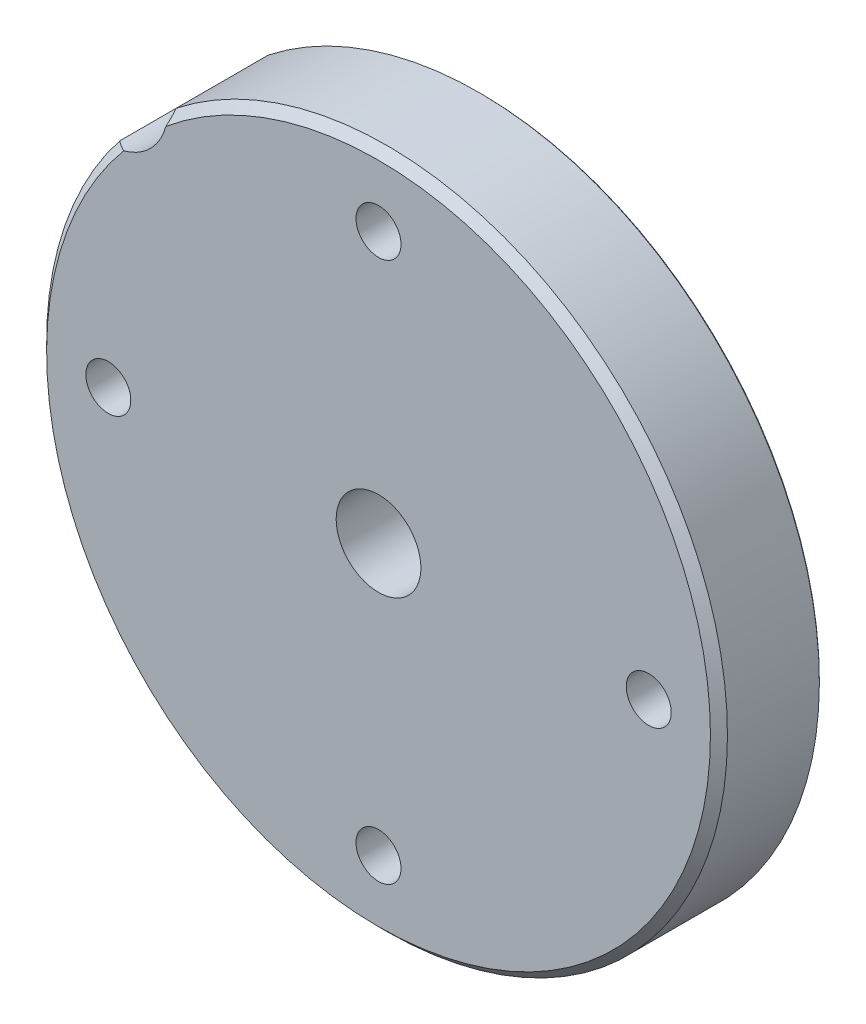
ISO-10303-21;
HEADER;
FILE_DESCRIPTION(('STEP AP214'),'2;1');
FILE_NAME('part.step','',(''),(''),'','','');
FILE_SCHEMA(('AUTOMOTIVE_DESIGN { 1 0 10303 214 1 1 1 1 }'));
ENDSEC;
DATA;
#1=APPLICATION_CONTEXT('core data for automotive mechanical design processes');
#2=APPLICATION_PROTOCOL_DEFINITION('international standard','automotive_design',2000,#1);
#3=PRODUCT_CONTEXT('',#1,'mechanical');
#4=PRODUCT('Part','Part','',(#3));
#5=PRODUCT_RELATED_PRODUCT_CATEGORY('part','',(#4));
#6=PRODUCT_DEFINITION_FORMATION('','',#4);
#7=PRODUCT_DEFINITION_CONTEXT('part definition',#1,'design');
#8=PRODUCT_DEFINITION('design','',#6,#7);
#9=PRODUCT_DEFINITION_SHAPE('','',#8);
#10=(LENGTH_UNIT() NAMED_UNIT(*) SI_UNIT(.MILLI.,.METRE.));
#11=(NAMED_UNIT(*) PLANE_ANGLE_UNIT() SI_UNIT($,.RADIAN.));
#12=(NAMED_UNIT(*) SI_UNIT($,.STERADIAN.) SOLID_ANGLE_UNIT());
#13=UNCERTAINTY_MEASURE_WITH_UNIT(LENGTH_MEASURE(1.E-05),#10,'distance_accuracy_value','');
#14=(GEOMETRIC_REPRESENTATION_CONTEXT(3) GLOBAL_UNCERTAINTY_ASSIGNED_CONTEXT((#13)) GLOBAL_UNIT_ASSIGNED_CONTEXT((#10,
#11,#12)) REPRESENTATION_CONTEXT('',''));
#15=CARTESIAN_POINT('',(0.,0.,0.));
#16=DIRECTION('',(0.,0.,1.));
#17=DIRECTION('',(1.,0.,0.));
#18=AXIS2_PLACEMENT_3D('',#15,#16,#17);
#19=CARTESIAN_POINT('',(0.,0.,-8.5));
#20=DIRECTION('',(0.,0.,1.));
#21=DIRECTION('',(1.,0.,0.));
#22=AXIS2_PLACEMENT_3D('',#19,#20,#21);
#23=CYLINDRICAL_SURFACE('',#22,5.6);
#24=CARTESIAN_POINT('',(0.,0.,-8.5));
#25=DIRECTION('',(0.,0.,1.));
#26=DIRECTION('',(1.,0.,0.));
#27=AXIS2_PLACEMENT_3D('',#24,#25,#26);
#28=CIRCLE('',#27,5.6);
#29=CARTESIAN_POINT('',(5.6,0.,-8.5));
#30=VERTEX_POINT('',#29);
#31=EDGE_CURVE('E353',#30,#30,#28,.F.);
#32=ORIENTED_EDGE('',*,*,#31,.T.);
#33=EDGE_LOOP('',(#32));
#34=FACE_BOUND('',#33,.T.);
#35=CARTESIAN_POINT('',(0.,0.,-7.));
#36=DIRECTION('',(0.,0.,1.));
#37=DIRECTION('',(1.,0.,0.));
#38=AXIS2_PLACEMENT_3D('',#35,#36,#37);
#39=CIRCLE('',#38,5.6);
#40=CARTESIAN_POINT('',(5.6,0.,-7.));
#41=VERTEX_POINT('',#40);
#42=EDGE_CURVE('E359',#41,#41,#39,.F.);
#43=ORIENTED_EDGE('',*,*,#42,.F.);
#44=EDGE_LOOP('',(#43));
#45=FACE_BOUND('',#44,.T.);
#46=ADVANCED_FACE('F17',(#34,#45),#23,.F.);
#47=CARTESIAN_POINT('',(0.,0.,-8.5));
#48=DIRECTION('',(0.,0.,-1.));
#49=DIRECTION('',(-1.,0.,0.));
#50=AXIS2_PLACEMENT_3D('',#47,#48,#49);
#51=PLANE('',#50);
#52=CARTESIAN_POINT('',(0.,0.,-8.5));
#53=DIRECTION('',(0.,0.,-1.));
#54=DIRECTION('',(-1.,0.,0.));
#55=AXIS2_PLACEMENT_3D('',#52,#53,#54);
#56=CIRCLE('',#55,5.5);
#57=CARTESIAN_POINT('',(-5.5,0.,-8.5));
#58=VERTEX_POINT('',#57);
#59=EDGE_CURVE('E362',#58,#58,#56,.F.);
#60=ORIENTED_EDGE('',*,*,#59,.F.);
#61=EDGE_LOOP('',(#60));
#62=FACE_BOUND('',#61,.T.);
#63=ORIENTED_EDGE('',*,*,#31,.F.);
#64=EDGE_LOOP('',(#63));
#65=FACE_BOUND('',#64,.T.);
#66=ADVANCED_FACE('F207',(#62,#65),#51,.F.);
#67=CARTESIAN_POINT('',(0.,0.,-7.));
#68=DIRECTION('',(0.,0.,1.));
#69=DIRECTION('',(1.,0.,0.));
#70=AXIS2_PLACEMENT_3D('',#67,#68,#69);
#71=PLANE('',#70);
#72=ORIENTED_EDGE('',*,*,#42,.T.);
#73=EDGE_LOOP('',(#72));
#74=FACE_BOUND('',#73,.T.);
#75=CARTESIAN_POINT('',(0.,0.,-7.));
#76=DIRECTION('',(0.,0.,1.));
#77=DIRECTION('',(1.,0.,0.));
#78=AXIS2_PLACEMENT_3D('',#75,#76,#77);
#79=CIRCLE('',#78,7.5);
#80=CARTESIAN_POINT('',(7.5,0.,-7.));
#81=VERTEX_POINT('',#80);
#82=EDGE_CURVE('E365',#81,#81,#79,.F.);
#83=ORIENTED_EDGE('',*,*,#82,.F.);
#84=EDGE_LOOP('',(#83));
#85=FACE_BOUND('',#84,.T.);
#86=ADVANCED_FACE('F203',(#74,#85),#71,.T.);
#87=CARTESIAN_POINT('',(0.,0.,-6.));
#88=DIRECTION('',(0.,0.,-1.));
#89=DIRECTION('',(-1.,0.,0.));
#90=AXIS2_PLACEMENT_3D('',#87,#88,#89);
#91=CYLINDRICAL_SURFACE('',#90,5.5);
#92=CARTESIAN_POINT('',(0.,0.,-6.));
#93=DIRECTION('',(0.,0.,-1.));
#94=DIRECTION('',(-1.,0.,0.));
#95=AXIS2_PLACEMENT_3D('',#92,#93,#94);
#96=CIRCLE('',#95,5.5);
#97=CARTESIAN_POINT('',(-5.5,0.,-6.));
#98=VERTEX_POINT('',#97);
#99=EDGE_CURVE('E90',#98,#98,#96,.F.);
#100=ORIENTED_EDGE('',*,*,#99,.F.);
#101=EDGE_LOOP('',(#100));
#102=FACE_BOUND('',#101,.T.);
#103=ORIENTED_EDGE('',*,*,#59,.T.);
#104=EDGE_LOOP('',(#103));
#105=FACE_BOUND('',#104,.T.);
#106=ADVANCED_FACE('F200',(#102,#105),#91,.T.);
#107=CARTESIAN_POINT('',(0.,6.,-10.));
#108=DIRECTION('',(0.,0.,-1.));
#109=DIRECTION('',(0.,1.,0.));
#110=AXIS2_PLACEMENT_3D('',#107,#108,#109);
#111=CONICAL_SURFACE('',#110,0.750000000000001,1.02974425867665);
#112=CARTESIAN_POINT('',(0.,6.,-9.54935453572933));
#113=VERTEX_POINT('',#112);
#114=VERTEX_LOOP('',#113);
#115=FACE_BOUND('',#114,.T.);
#116=CARTESIAN_POINT('',(0.,6.,-10.));
#117=DIRECTION('',(0.,0.,-1.));
#118=DIRECTION('',(-1.,0.,0.));
#119=AXIS2_PLACEMENT_3D('',#116,#117,#118);
#120=CIRCLE('',#119,0.75);
#121=CARTESIAN_POINT('',(-0.750000000000005,6.,-10.));
#122=VERTEX_POINT('',#121);
#123=EDGE_CURVE('E84',#122,#122,#120,.T.);
#124=ORIENTED_EDGE('',*,*,#123,.T.);
#125=EDGE_LOOP('',(#124));
#126=FACE_BOUND('',#125,.T.);
#127=ADVANCED_FACE('F77',(#115,#126),#111,.F.);
#128=CARTESIAN_POINT('',(0.,-6.,-10.));
#129=DIRECTION('',(0.,0.,-1.));
#130=DIRECTION('',(0.,1.,0.));
#131=AXIS2_PLACEMENT_3D('',#128,#129,#130);
#132=CONICAL_SURFACE('',#131,0.75,1.02974425867665);
#133=CARTESIAN_POINT('',(0.,-6.,-9.54935453572933));
#134=VERTEX_POINT('',#133);
#135=VERTEX_LOOP('',#134);
#136=FACE_BOUND('',#135,.T.);
#137=CARTESIAN_POINT('',(0.,-6.,-10.));
#138=DIRECTION('',(0.,0.,-1.));
#139=DIRECTION('',(-1.,0.,0.));
#140=AXIS2_PLACEMENT_3D('',#137,#138,#139);
#141=CIRCLE('',#140,0.750000000000002);
#142=CARTESIAN_POINT('',(-0.749999999999997,-6.,-10.));
#143=VERTEX_POINT('',#142);
#144=EDGE_CURVE('E81',#143,#143,#141,.T.);
#145=ORIENTED_EDGE('',*,*,#144,.T.);
#146=EDGE_LOOP('',(#145));
#147=FACE_BOUND('',#146,.T.);
#148=ADVANCED_FACE('F73',(#136,#147),#132,.F.);
#149=CARTESIAN_POINT('',(0.,0.,-6.));
#150=DIRECTION('',(0.,0.,-1.));
#151=DIRECTION('',(-1.,0.,0.));
#152=AXIS2_PLACEMENT_3D('',#149,#150,#151);
#153=PLANE('',#152);
#154=ORIENTED_EDGE('',*,*,#99,.T.);
#155=EDGE_LOOP('',(#154));
#156=FACE_BOUND('',#155,.T.);
#157=CARTESIAN_POINT('',(0.,0.,-6.));
#158=DIRECTION('',(0.,0.,-1.));
#159=DIRECTION('',(-1.,0.,0.));
#160=AXIS2_PLACEMENT_3D('',#157,#158,#159);
#161=CIRCLE('',#160,10.5);
#162=CARTESIAN_POINT('',(-10.5,0.,-6.));
#163=VERTEX_POINT('',#162);
#164=EDGE_CURVE('E83',#163,#163,#161,.T.);
#165=ORIENTED_EDGE('',*,*,#164,.T.);
#166=EDGE_LOOP('',(#165));
#167=FACE_BOUND('',#166,.T.);
#168=ADVANCED_FACE('F76',(#156,#167),#153,.T.);
#169=CARTESIAN_POINT('',(0.,0.,-8.5));
#170=DIRECTION('',(0.,0.,-1.));
#171=DIRECTION('',(0.,1.,0.));
#172=AXIS2_PLACEMENT_3D('',#169,#170,#171);
#173=CYLINDRICAL_SURFACE('',#172,7.5);
#174=CARTESIAN_POINT('',(0.,0.,-11.5));
#175=DIRECTION('',(0.,0.,-1.));
#176=DIRECTION('',(0.,1.,0.));
#177=AXIS2_PLACEMENT_3D('',#174,#175,#176);
#178=CIRCLE('',#177,7.5);
#179=CARTESIAN_POINT('',(0.,7.5,-11.5));
#180=VERTEX_POINT('',#179);
#181=EDGE_CURVE('E87',#180,#180,#178,.T.);
#182=ORIENTED_EDGE('',*,*,#181,.F.);
#183=EDGE_LOOP('',(#182));
#184=FACE_BOUND('',#183,.T.);
#185=ORIENTED_EDGE('',*,*,#82,.T.);
#186=EDGE_LOOP('',(#185));
#187=FACE_BOUND('',#186,.T.);
#188=ADVANCED_FACE('F192',(#184,#187),#173,.T.);
#189=CARTESIAN_POINT('',(0.,6.,-11.5));
#190=DIRECTION('',(0.,0.,1.));
#191=DIRECTION('',(1.,0.,0.));
#192=AXIS2_PLACEMENT_3D('',#189,#190,#191);
#193=CYLINDRICAL_SURFACE('',#192,0.75);
#194=ORIENTED_EDGE('',*,*,#123,.F.);
#195=EDGE_LOOP('',(#194));
#196=FACE_BOUND('',#195,.T.);
#197=CARTESIAN_POINT('',(0.,6.,-11.5));
#198=DIRECTION('',(0.,0.,1.));
#199=DIRECTION('',(1.,0.,0.));
#200=AXIS2_PLACEMENT_3D('',#197,#198,#199);
#201=CIRCLE('',#200,0.75);
#202=CARTESIAN_POINT('',(0.749999999999996,6.,-11.5));
#203=VERTEX_POINT('',#202);
#204=EDGE_CURVE('E372',#203,#203,#201,.T.);
#205=ORIENTED_EDGE('',*,*,#204,.F.);
#206=EDGE_LOOP('',(#205));
#207=FACE_BOUND('',#206,.T.);
#208=ADVANCED_FACE('F195',(#196,#207),#193,.F.);
#209=CARTESIAN_POINT('',(0.,-6.,-11.5));
#210=DIRECTION('',(0.,0.,1.));
#211=DIRECTION('',(1.,0.,0.));
#212=AXIS2_PLACEMENT_3D('',#209,#210,#211);
#213=CYLINDRICAL_SURFACE('',#212,0.750000000000002);
#214=ORIENTED_EDGE('',*,*,#144,.F.);
#215=EDGE_LOOP('',(#214));
#216=FACE_BOUND('',#215,.T.);
#217=CARTESIAN_POINT('',(0.,-6.,-11.5));
#218=DIRECTION('',(0.,0.,1.));
#219=DIRECTION('',(1.,0.,0.));
#220=AXIS2_PLACEMENT_3D('',#217,#218,#219);
#221=CIRCLE('',#220,0.750000000000002);
#222=CARTESIAN_POINT('',(0.750000000000007,-6.,-11.5));
#223=VERTEX_POINT('',#222);
#224=EDGE_CURVE('E375',#223,#223,#221,.T.);
#225=ORIENTED_EDGE('',*,*,#224,.F.);
#226=EDGE_LOOP('',(#225));
#227=FACE_BOUND('',#226,.T.);
#228=ADVANCED_FACE('F190',(#216,#227),#213,.F.);
#229=CARTESIAN_POINT('',(0.,0.,-6.));
#230=DIRECTION('',(0.,0.,-1.));
#231=DIRECTION('',(-1.,0.,0.));
#232=AXIS2_PLACEMENT_3D('',#229,#230,#231);
#233=CYLINDRICAL_SURFACE('',#232,10.5);
#234=ORIENTED_EDGE('',*,*,#164,.F.);
#235=EDGE_LOOP('',(#234));
#236=FACE_BOUND('',#235,.T.);
#237=CARTESIAN_POINT('',(0.,0.,-10.5));
#238=DIRECTION('',(0.,0.,-1.));
#239=DIRECTION('',(-1.,0.,0.));
#240=AXIS2_PLACEMENT_3D('',#237,#238,#239);
#241=CIRCLE('',#240,10.5);
#242=CARTESIAN_POINT('',(-10.5,0.,-10.5));
#243=VERTEX_POINT('',#242);
#244=EDGE_CURVE('E377',#243,#243,#241,.T.);
#245=ORIENTED_EDGE('',*,*,#244,.T.);
#246=EDGE_LOOP('',(#245));
#247=FACE_BOUND('',#246,.T.);
#248=ADVANCED_FACE('F186',(#236,#247),#233,.F.);
#249=CARTESIAN_POINT('',(0.,0.,-10.5));
#250=DIRECTION('',(0.,0.,1.));
#251=DIRECTION('',(1.,0.,0.));
#252=AXIS2_PLACEMENT_3D('',#249,#250,#251);
#253=PLANE('',#252);
#254=ORIENTED_EDGE('',*,*,#244,.F.);
#255=EDGE_LOOP('',(#254));
#256=FACE_BOUND('',#255,.T.);
#257=CARTESIAN_POINT('',(0.,0.,-10.5));
#258=DIRECTION('',(0.,0.,-1.));
#259=DIRECTION('',(-1.,0.,0.));
#260=AXIS2_PLACEMENT_3D('',#257,#258,#259);
#261=CIRCLE('',#260,13.);
#262=CARTESIAN_POINT('',(-13.,0.,-10.5));
#263=VERTEX_POINT('',#262);
#264=EDGE_CURVE('E162',#263,#263,#261,.F.);
#265=ORIENTED_EDGE('',*,*,#264,.F.);
#266=EDGE_LOOP('',(#265));
#267=FACE_BOUND('',#266,.T.);
#268=ADVANCED_FACE('F181',(#256,#267),#253,.F.);
#269=CARTESIAN_POINT('',(0.,0.,-5.89999999995513));
#270=DIRECTION('',(0.,0.,1.));
#271=DIRECTION('',(0.,-1.,0.));
#272=AXIS2_PLACEMENT_3D('',#269,#270,#271);
#273=CONICAL_SURFACE('',#272,19.9999999999551,0.785398162500006);
#274=CARTESIAN_POINT('',(-15.7086426515068,12.378955773649,-5.89999999994284));
#275=CARTESIAN_POINT('',(-15.6863217931569,12.3800149369185,-5.91687699793065));
#276=CARTESIAN_POINT('',(-15.6639376875693,12.3812957540872,-5.93364883022015));
#277=CARTESIAN_POINT('',(-15.6190429816601,12.3843006962397,-5.96698216359461));
#278=CARTESIAN_POINT('',(-15.596532381337,12.3860248212288,-5.98354366467714));
#279=CARTESIAN_POINT('',(-15.5739585337748,12.3879706001221,-6.00000000005895));
#280=B_SPLINE_CURVE_WITH_KNOTS('',3,(#274,#275,#276,#277,#278,#279),.UNSPECIFIED.,.F.,.F.,(4,2,
4),(0.,0.0839990910981078,0.167998183164096),.UNSPECIFIED.);
#281=CARTESIAN_POINT('',(-15.7086426515284,12.378955773648,-5.89999999997142));
#282=VERTEX_POINT('',#281);
#283=CARTESIAN_POINT('',(-15.5739585337846,12.3879706001212,-6.00000000003206));
#284=VERTEX_POINT('',#283);
#285=EDGE_CURVE('E165',#282,#284,#280,.T.);
#286=ORIENTED_EDGE('',*,*,#285,.T.);
#287=CARTESIAN_POINT('',(0.,0.,-6.00000000004487));
#288=DIRECTION('',(0.,0.,1.));
#289=DIRECTION('',(0.,-1.,0.));
#290=AXIS2_PLACEMENT_3D('',#287,#288,#289);
#291=CIRCLE('',#290,19.9000000000449);
#292=CARTESIAN_POINT('',(-12.3879706001212,15.5739585337846,-6.00000000003206));
#293=VERTEX_POINT('',#292);
#294=EDGE_CURVE('E159',#293,#284,#291,.F.);
#295=ORIENTED_EDGE('',*,*,#294,.F.);
#296=CARTESIAN_POINT('',(-12.3879706001066,15.5739585337682,-6.00000000005114));
#297=CARTESIAN_POINT('',(-12.3860248212211,15.5965323813338,-5.98354366467319));
#298=CARTESIAN_POINT('',(-12.3843006962372,15.6190429816591,-5.96698216359325));
#299=CARTESIAN_POINT('',(-12.3812957540897,15.6639376875705,-5.93364883022139));
#300=CARTESIAN_POINT('',(-12.3800149369211,15.6863217931581,-5.91687699793191));
#301=CARTESIAN_POINT('',(-12.378955773649,15.7086426515068,-5.89999999994284));
#302=B_SPLINE_CURVE_WITH_KNOTS('',3,(#296,#297,#298,#299,#300,#301),.UNSPECIFIED.,.F.,.F.,(4,2,
4),(0.,0.0839990920658283,0.167998183163858),.UNSPECIFIED.);
#303=CARTESIAN_POINT('',(-12.378955773648,15.7086426515284,-5.89999999997142));
#304=VERTEX_POINT('',#303);
#305=EDGE_CURVE('E57',#293,#304,#302,.T.);
#306=ORIENTED_EDGE('',*,*,#305,.T.);
#307=CARTESIAN_POINT('',(0.,0.,-5.9));
#308=DIRECTION('',(0.,0.,-1.));
#309=DIRECTION('',(-1.,0.,0.));
#310=AXIS2_PLACEMENT_3D('',#307,#308,#309);
#311=CIRCLE('',#310,20.);
#312=EDGE_CURVE('E94',#282,#304,#311,.F.);
#313=ORIENTED_EDGE('',*,*,#312,.F.);
#314=EDGE_LOOP('',(#286,#295,#306,#313));
#315=FACE_BOUND('',#314,.T.);
#316=ADVANCED_FACE('F175',(#315),#273,.T.);
#317=CARTESIAN_POINT('',(0.,0.,-6.));
#318=DIRECTION('',(0.,0.,-1.));
#319=DIRECTION('',(-1.,0.,0.));
#320=AXIS2_PLACEMENT_3D('',#317,#318,#319);
#321=CYLINDRICAL_SURFACE('',#320,13.);
#322=CARTESIAN_POINT('',(0.,0.,-6.));
#323=DIRECTION('',(0.,0.,-1.));
#324=DIRECTION('',(-1.,0.,0.));
#325=AXIS2_PLACEMENT_3D('',#322,#323,#324);
#326=CIRCLE('',#325,13.);
#327=CARTESIAN_POINT('',(-13.,0.,-6.));
#328=VERTEX_POINT('',#327);
#329=EDGE_CURVE('E156',#328,#328,#326,.F.);
#330=ORIENTED_EDGE('',*,*,#329,.F.);
#331=EDGE_LOOP('',(#330));
#332=FACE_BOUND('',#331,.T.);
#333=ORIENTED_EDGE('',*,*,#264,.T.);
#334=EDGE_LOOP('',(#333));
#335=FACE_BOUND('',#334,.T.);
#336=ADVANCED_FACE('F180',(#332,#335),#321,.T.);
#337=CARTESIAN_POINT('',(0.,0.,0.));
#338=DIRECTION('',(0.,0.,-1.));
#339=DIRECTION('',(-1.,0.,0.));
#340=AXIS2_PLACEMENT_3D('',#337,#338,#339);
#341=CYLINDRICAL_SURFACE('',#340,20.);
#342=DIRECTION('',(0.,0.,-1.));
#343=VECTOR('',#342,1.);
#344=CARTESIAN_POINT('',(-15.7086426515499,12.3789557736469,0.));
#345=LINE('',#344,#343);
#346=CARTESIAN_POINT('',(-15.7086426514015,12.378955773654,-0.500000000336547));
#347=VERTEX_POINT('',#346);
#348=EDGE_CURVE('E155',#347,#282,#345,.T.);
#349=ORIENTED_EDGE('',*,*,#348,.T.);
#350=ORIENTED_EDGE('',*,*,#312,.T.);
#351=DIRECTION('',(0.,0.,-1.));
#352=VECTOR('',#351,1.);
#353=CARTESIAN_POINT('',(-12.3789557736469,15.7086426515499,0.));
#354=LINE('',#353,#352);
#355=CARTESIAN_POINT('',(-12.378955773654,15.7086426514015,-0.500000000224363));
#356=VERTEX_POINT('',#355);
#357=EDGE_CURVE('E138',#304,#356,#354,.F.);
#358=ORIENTED_EDGE('',*,*,#357,.T.);
#359=CARTESIAN_POINT('',(0.,0.,-0.500000000224363));
#360=DIRECTION('',(0.,0.,-1.));
#361=DIRECTION('',(-1.,0.,0.));
#362=AXIS2_PLACEMENT_3D('',#359,#360,#361);
#363=CIRCLE('',#362,19.9999999997756);
#364=EDGE_CURVE('E65',#347,#356,#363,.F.);
#365=ORIENTED_EDGE('',*,*,#364,.F.);
#366=EDGE_LOOP('',(#349,#350,#358,#365));
#367=FACE_BOUND('',#366,.T.);
#368=ADVANCED_FACE('F385',(#367),#341,.T.);
#369=CARTESIAN_POINT('',(0.,0.,-11.5));
#370=DIRECTION('',(0.,0.,1.));
#371=DIRECTION('',(1.,0.,0.));
#372=AXIS2_PLACEMENT_3D('',#369,#370,#371);
#373=PLANE('',#372);
#374=CARTESIAN_POINT('',(0.,0.,-11.5));
#375=DIRECTION('',(0.,0.,-1.));
#376=DIRECTION('',(-1.,0.,0.));
#377=AXIS2_PLACEMENT_3D('',#374,#375,#376);
#378=CIRCLE('',#377,2.489);
#379=CARTESIAN_POINT('',(-2.489,0.,-11.5));
#380=VERTEX_POINT('',#379);
#381=EDGE_CURVE('E128',#380,#380,#378,.F.);
#382=ORIENTED_EDGE('',*,*,#381,.T.);
#383=EDGE_LOOP('',(#382));
#384=FACE_BOUND('',#383,.T.);
#385=ORIENTED_EDGE('',*,*,#224,.T.);
#386=EDGE_LOOP('',(#385));
#387=FACE_BOUND('',#386,.T.);
#388=ORIENTED_EDGE('',*,*,#204,.T.);
#389=EDGE_LOOP('',(#388));
#390=FACE_BOUND('',#389,.T.);
#391=ORIENTED_EDGE('',*,*,#181,.T.);
#392=EDGE_LOOP('',(#391));
#393=FACE_BOUND('',#392,.T.);
#394=ADVANCED_FACE('F390',(#384,#387,#390,#393),#373,.F.);
#395=CARTESIAN_POINT('',(0.,0.,-6.));
#396=DIRECTION('',(0.,0.,-1.));
#397=DIRECTION('',(-1.,0.,0.));
#398=AXIS2_PLACEMENT_3D('',#395,#396,#397);
#399=PLANE('',#398);
#400=ORIENTED_EDGE('',*,*,#329,.T.);
#401=EDGE_LOOP('',(#400));
#402=FACE_BOUND('',#401,.T.);
#403=CARTESIAN_POINT('',(0.,15.875,-6.));
#404=DIRECTION('',(0.,0.,-1.));
#405=DIRECTION('',(-1.,0.,0.));
#406=AXIS2_PLACEMENT_3D('',#403,#404,#405);
#407=CIRCLE('',#406,1.321);
#408=CARTESIAN_POINT('',(-1.321,15.875,-6.));
#409=VERTEX_POINT('',#408);
#410=EDGE_CURVE('E116',#409,#409,#407,.F.);
#411=ORIENTED_EDGE('',*,*,#410,.T.);
#412=EDGE_LOOP('',(#411));
#413=FACE_BOUND('',#412,.T.);
#414=CARTESIAN_POINT('',(-15.875,0.,-6.));
#415=DIRECTION('',(0.,0.,-1.));
#416=DIRECTION('',(-1.,0.,0.));
#417=AXIS2_PLACEMENT_3D('',#414,#415,#416);
#418=CIRCLE('',#417,1.321);
#419=CARTESIAN_POINT('',(-17.196,0.,-6.));
#420=VERTEX_POINT('',#419);
#421=EDGE_CURVE('E119',#420,#420,#418,.F.);
#422=ORIENTED_EDGE('',*,*,#421,.T.);
#423=EDGE_LOOP('',(#422));
#424=FACE_BOUND('',#423,.T.);
#425=CARTESIAN_POINT('',(0.,-15.875,-6.));
#426=DIRECTION('',(0.,0.,-1.));
#427=DIRECTION('',(-1.,0.,0.));
#428=AXIS2_PLACEMENT_3D('',#425,#426,#427);
#429=CIRCLE('',#428,1.321);
#430=CARTESIAN_POINT('',(-1.321,-15.875,-6.));
#431=VERTEX_POINT('',#430);
#432=EDGE_CURVE('E122',#431,#431,#429,.F.);
#433=ORIENTED_EDGE('',*,*,#432,.T.);
#434=EDGE_LOOP('',(#433));
#435=FACE_BOUND('',#434,.T.);
#436=CARTESIAN_POINT('',(15.875,0.,-6.));
#437=DIRECTION('',(0.,0.,-1.));
#438=DIRECTION('',(-1.,0.,0.));
#439=AXIS2_PLACEMENT_3D('',#436,#437,#438);
#440=CIRCLE('',#439,1.321);
#441=CARTESIAN_POINT('',(14.554,0.,-6.));
#442=VERTEX_POINT('',#441);
#443=EDGE_CURVE('E125',#442,#442,#440,.F.);
#444=ORIENTED_EDGE('',*,*,#443,.T.);
#445=EDGE_LOOP('',(#444));
#446=FACE_BOUND('',#445,.T.);
#447=CARTESIAN_POINT('',(-15.875,15.875,-6.));
#448=DIRECTION('',(0.,0.,-1.));
#449=DIRECTION('',(-1.,0.,0.));
#450=AXIS2_PLACEMENT_3D('',#447,#448,#449);
#451=CIRCLE('',#450,3.5);
#452=EDGE_CURVE('E139',#284,#293,#451,.F.);
#453=ORIENTED_EDGE('',*,*,#452,.T.);
#454=ORIENTED_EDGE('',*,*,#294,.T.);
#455=EDGE_LOOP('',(#453,#454));
#456=FACE_BOUND('',#455,.T.);
#457=ADVANCED_FACE('F148',(#402,#413,#424,#435,#446,#456),#399,.T.);
#458=CARTESIAN_POINT('',(0.,0.,-0.500000000224362));
#459=DIRECTION('',(0.,0.,-1.));
#460=DIRECTION('',(-1.,0.,0.));
#461=AXIS2_PLACEMENT_3D('',#458,#459,#460);
#462=CONICAL_SURFACE('',#461,19.9999999997756,0.7853981625);
#463=CARTESIAN_POINT('',(-14.9720796613635,12.4934715197705,3.03074630363293E-10));
#464=CARTESIAN_POINT('',(-15.0349118656529,12.4766971667001,-0.0374967032172429));
#465=CARTESIAN_POINT('',(-15.0974871059822,12.461861598597,-0.0762526913637164));
#466=CARTESIAN_POINT('',(-15.2218118801087,12.4359055815083,-0.155860450577804));
#467=CARTESIAN_POINT('',(-15.2835632844114,12.4247744660695,-0.196705806825764));
#468=CARTESIAN_POINT('',(-15.4062889045965,12.4059707605476,-0.280286681059573));
#469=CARTESIAN_POINT('',(-15.4672631989245,12.3982978186476,-0.323022006283722));
#470=CARTESIAN_POINT('',(-15.5885320631262,12.3862101108959,-0.410266968625191));
#471=CARTESIAN_POINT('',(-15.6488241358321,12.3818049003551,-0.454781411279927));
#472=CARTESIAN_POINT('',(-15.7086426513304,12.3789557736574,-0.500000000282737));
#473=B_SPLINE_CURVE_WITH_KNOTS('',3,(#463,#464,#465,#466,#467,#468,#469,#470,#471,#472),
.UNSPECIFIED.,.F.,.F.,(4,2,2,2,4),(0.,0.225141521834317,0.449629055320701,0.674093745442383,
0.899212242405961),.UNSPECIFIED.);
#474=CARTESIAN_POINT('',(-14.9720796614959,12.493471519813,1.8352917041078E-10));
#475=VERTEX_POINT('',#474);
#476=EDGE_CURVE('E36',#475,#347,#473,.T.);
#477=ORIENTED_EDGE('',*,*,#476,.T.);
#478=ORIENTED_EDGE('',*,*,#364,.T.);
#479=CARTESIAN_POINT('',(-12.378955773699,15.7086426513519,-0.500000000265221));
#480=CARTESIAN_POINT('',(-12.3818049003681,15.6488241358403,-0.454781411275603));
#481=CARTESIAN_POINT('',(-12.3862101108989,15.5885320631293,-0.410266968625058));
#482=CARTESIAN_POINT('',(-12.3982978186445,15.4672631989238,-0.323022006285581));
#483=CARTESIAN_POINT('',(-12.4059707605483,15.4062889045971,-0.28028668105924));
#484=CARTESIAN_POINT('',(-12.424774466069,15.2835632844099,-0.196705806825471));
#485=CARTESIAN_POINT('',(-12.4359055815026,15.2218118801037,-0.155860450579748));
#486=CARTESIAN_POINT('',(-12.4618615986037,15.0974871059821,-0.0762526913585421));
#487=CARTESIAN_POINT('',(-12.4766971667245,15.0349118656614,-0.0374967032026958));
#488=CARTESIAN_POINT('',(-12.4934715198399,14.9720796613952,3.40642924731453E-10));
#489=B_SPLINE_CURVE_WITH_KNOTS('',3,(#479,#480,#481,#482,#483,#484,#485,#486,#487,#488),
.UNSPECIFIED.,.F.,.F.,(4,2,2,2,4),(0.,0.225118496966822,0.449583187090194,0.67407072057887,
0.899212242417132),.UNSPECIFIED.);
#490=CARTESIAN_POINT('',(-12.493471519813,14.9720796614959,1.83527897573657E-10));
#491=VERTEX_POINT('',#490);
#492=EDGE_CURVE('E131',#356,#491,#489,.T.);
#493=ORIENTED_EDGE('',*,*,#492,.T.);
#494=CARTESIAN_POINT('',(0.,0.,2.24362520749588E-10));
#495=DIRECTION('',(0.,0.,-1.));
#496=DIRECTION('',(-1.,0.,0.));
#497=AXIS2_PLACEMENT_3D('',#494,#495,#496);
#498=CIRCLE('',#497,19.5000000002244);
#499=EDGE_CURVE('E113',#491,#475,#498,.T.);
#500=ORIENTED_EDGE('',*,*,#499,.T.);
#501=EDGE_LOOP('',(#477,#478,#493,#500));
#502=FACE_BOUND('',#501,.T.);
#503=ADVANCED_FACE('F144',(#502),#462,.T.);
#504=CARTESIAN_POINT('',(-15.875,15.875,0.));
#505=DIRECTION('',(0.,0.,-1.));
#506=DIRECTION('',(-1.,0.,0.));
#507=AXIS2_PLACEMENT_3D('',#504,#505,#506);
#508=CYLINDRICAL_SURFACE('',#507,3.5);
#509=ORIENTED_EDGE('',*,*,#357,.F.);
#510=ORIENTED_EDGE('',*,*,#305,.F.);
#511=ORIENTED_EDGE('',*,*,#452,.F.);
#512=ORIENTED_EDGE('',*,*,#285,.F.);
#513=ORIENTED_EDGE('',*,*,#348,.F.);
#514=ORIENTED_EDGE('',*,*,#476,.F.);
#515=CARTESIAN_POINT('',(-15.875,15.875,0.));
#516=DIRECTION('',(0.,0.,-1.));
#517=DIRECTION('',(-1.,0.,0.));
#518=AXIS2_PLACEMENT_3D('',#515,#516,#517);
#519=CIRCLE('',#518,3.5);
#520=EDGE_CURVE('E111',#475,#491,#519,.F.);
#521=ORIENTED_EDGE('',*,*,#520,.T.);
#522=ORIENTED_EDGE('',*,*,#492,.F.);
#523=EDGE_LOOP('',(#509,#510,#511,#512,#513,#514,#521,#522));
#524=FACE_BOUND('',#523,.T.);
#525=ADVANCED_FACE('F141',(#524),#508,.F.);
#526=CARTESIAN_POINT('',(0.,0.,0.));
#527=DIRECTION('',(0.,0.,-1.));
#528=DIRECTION('',(-1.,0.,0.));
#529=AXIS2_PLACEMENT_3D('',#526,#527,#528);
#530=CYLINDRICAL_SURFACE('',#529,2.489);
#531=ORIENTED_EDGE('',*,*,#381,.F.);
#532=EDGE_LOOP('',(#531));
#533=FACE_BOUND('',#532,.T.);
#534=CARTESIAN_POINT('',(0.,0.,0.));
#535=DIRECTION('',(0.,0.,-1.));
#536=DIRECTION('',(-1.,0.,0.));
#537=AXIS2_PLACEMENT_3D('',#534,#535,#536);
#538=CIRCLE('',#537,2.489);
#539=CARTESIAN_POINT('',(-2.489,0.,0.));
#540=VERTEX_POINT('',#539);
#541=EDGE_CURVE('E108',#540,#540,#538,.F.);
#542=ORIENTED_EDGE('',*,*,#541,.T.);
#543=EDGE_LOOP('',(#542));
#544=FACE_BOUND('',#543,.T.);
#545=ADVANCED_FACE('F223',(#533,#544),#530,.F.);
#546=CARTESIAN_POINT('',(15.875,0.,0.));
#547=DIRECTION('',(0.,0.,-1.));
#548=DIRECTION('',(-1.,0.,0.));
#549=AXIS2_PLACEMENT_3D('',#546,#547,#548);
#550=CYLINDRICAL_SURFACE('',#549,1.321);
#551=ORIENTED_EDGE('',*,*,#443,.F.);
#552=EDGE_LOOP('',(#551));
#553=FACE_BOUND('',#552,.T.);
#554=CARTESIAN_POINT('',(15.875,0.,0.));
#555=DIRECTION('',(0.,0.,-1.));
#556=DIRECTION('',(-1.,0.,0.));
#557=AXIS2_PLACEMENT_3D('',#554,#555,#556);
#558=CIRCLE('',#557,1.321);
#559=CARTESIAN_POINT('',(14.554,0.,0.));
#560=VERTEX_POINT('',#559);
#561=EDGE_CURVE('E105',#560,#560,#558,.F.);
#562=ORIENTED_EDGE('',*,*,#561,.T.);
#563=EDGE_LOOP('',(#562));
#564=FACE_BOUND('',#563,.T.);
#565=ADVANCED_FACE('F226',(#553,#564),#550,.F.);
#566=CARTESIAN_POINT('',(0.,-15.875,0.));
#567=DIRECTION('',(0.,0.,-1.));
#568=DIRECTION('',(-1.,0.,0.));
#569=AXIS2_PLACEMENT_3D('',#566,#567,#568);
#570=CYLINDRICAL_SURFACE('',#569,1.321);
#571=ORIENTED_EDGE('',*,*,#432,.F.);
#572=EDGE_LOOP('',(#571));
#573=FACE_BOUND('',#572,.T.);
#574=CARTESIAN_POINT('',(0.,-15.875,0.));
#575=DIRECTION('',(0.,0.,-1.));
#576=DIRECTION('',(-1.,0.,0.));
#577=AXIS2_PLACEMENT_3D('',#574,#575,#576);
#578=CIRCLE('',#577,1.321);
#579=CARTESIAN_POINT('',(-1.321,-15.875,0.));
#580=VERTEX_POINT('',#579);
#581=EDGE_CURVE('E102',#580,#580,#578,.F.);
#582=ORIENTED_EDGE('',*,*,#581,.T.);
#583=EDGE_LOOP('',(#582));
#584=FACE_BOUND('',#583,.T.);
#585=ADVANCED_FACE('F230',(#573,#584),#570,.F.);
#586=CARTESIAN_POINT('',(-15.875,0.,0.));
#587=DIRECTION('',(0.,0.,-1.));
#588=DIRECTION('',(-1.,0.,0.));
#589=AXIS2_PLACEMENT_3D('',#586,#587,#588);
#590=CYLINDRICAL_SURFACE('',#589,1.321);
#591=ORIENTED_EDGE('',*,*,#421,.F.);
#592=EDGE_LOOP('',(#591));
#593=FACE_BOUND('',#592,.T.);
#594=CARTESIAN_POINT('',(-15.875,0.,0.));
#595=DIRECTION('',(0.,0.,-1.));
#596=DIRECTION('',(-1.,0.,0.));
#597=AXIS2_PLACEMENT_3D('',#594,#595,#596);
#598=CIRCLE('',#597,1.321);
#599=CARTESIAN_POINT('',(-17.196,0.,0.));
#600=VERTEX_POINT('',#599);
#601=EDGE_CURVE('E27',#600,#600,#598,.F.);
#602=ORIENTED_EDGE('',*,*,#601,.T.);
#603=EDGE_LOOP('',(#602));
#604=FACE_BOUND('',#603,.T.);
#605=ADVANCED_FACE('F234',(#593,#604),#590,.F.);
#606=CARTESIAN_POINT('',(0.,15.875,0.));
#607=DIRECTION('',(0.,0.,-1.));
#608=DIRECTION('',(-1.,0.,0.));
#609=AXIS2_PLACEMENT_3D('',#606,#607,#608);
#610=CYLINDRICAL_SURFACE('',#609,1.321);
#611=ORIENTED_EDGE('',*,*,#410,.F.);
#612=EDGE_LOOP('',(#611));
#613=FACE_BOUND('',#612,.T.);
#614=CARTESIAN_POINT('',(0.,15.875,0.));
#615=DIRECTION('',(0.,0.,-1.));
#616=DIRECTION('',(-1.,0.,0.));
#617=AXIS2_PLACEMENT_3D('',#614,#615,#616);
#618=CIRCLE('',#617,1.321);
#619=CARTESIAN_POINT('',(-1.321,15.875,0.));
#620=VERTEX_POINT('',#619);
#621=EDGE_CURVE('E11',#620,#620,#618,.F.);
#622=ORIENTED_EDGE('',*,*,#621,.T.);
#623=EDGE_LOOP('',(#622));
#624=FACE_BOUND('',#623,.T.);
#625=ADVANCED_FACE('F237',(#613,#624),#610,.F.);
#626=CARTESIAN_POINT('',(0.,0.,0.));
#627=DIRECTION('',(0.,0.,-1.));
#628=DIRECTION('',(-1.,0.,0.));
#629=AXIS2_PLACEMENT_3D('',#626,#627,#628);
#630=PLANE('',#629);
#631=ORIENTED_EDGE('',*,*,#621,.F.);
#632=EDGE_LOOP('',(#631));
#633=FACE_BOUND('',#632,.T.);
#634=ORIENTED_EDGE('',*,*,#601,.F.);
#635=EDGE_LOOP('',(#634));
#636=FACE_BOUND('',#635,.T.);
#637=ORIENTED_EDGE('',*,*,#581,.F.);
#638=EDGE_LOOP('',(#637));
#639=FACE_BOUND('',#638,.T.);
#640=ORIENTED_EDGE('',*,*,#561,.F.);
#641=EDGE_LOOP('',(#640));
#642=FACE_BOUND('',#641,.T.);
#643=ORIENTED_EDGE('',*,*,#541,.F.);
#644=EDGE_LOOP('',(#643));
#645=FACE_BOUND('',#644,.T.);
#646=ORIENTED_EDGE('',*,*,#499,.F.);
#647=ORIENTED_EDGE('',*,*,#520,.F.);
#648=EDGE_LOOP('',(#646,#647));
#649=FACE_BOUND('',#648,.T.);
#650=ADVANCED_FACE('F240',(#633,#636,#639,#642,#645,#649),#630,.F.);
#651=CLOSED_SHELL('',(#46,#66,#86,#106,#127,#148,#168,#188,#208,#228,#248,#268,#316,#336,#368,
#394,#457,#503,#525,#545,#565,#585,#605,#625,#650));
#652=CARTESIAN_POINT('',(0.,0.,-8.5));
#653=DIRECTION('',(0.,0.,-1.));
#654=DIRECTION('',(-1.,0.,0.));
#655=AXIS2_PLACEMENT_3D('',#652,#653,#654);
#656=CYLINDRICAL_SURFACE('',#655,3.5);
#657=CARTESIAN_POINT('',(0.,0.,-8.5));
#658=DIRECTION('',(0.,0.,-1.));
#659=DIRECTION('',(-1.,0.,0.));
#660=AXIS2_PLACEMENT_3D('',#657,#658,#659);
#661=CIRCLE('',#660,3.5);
#662=CARTESIAN_POINT('',(-3.5,0.,-8.5));
#663=VERTEX_POINT('',#662);
#664=EDGE_CURVE('E21',#663,#663,#661,.T.);
#665=ORIENTED_EDGE('',*,*,#664,.T.);
#666=EDGE_LOOP('',(#665));
#667=FACE_BOUND('',#666,.T.);
#668=CARTESIAN_POINT('',(0.,0.,-9.5));
#669=DIRECTION('',(0.,0.,-1.));
#670=DIRECTION('',(-1.,0.,0.));
#671=AXIS2_PLACEMENT_3D('',#668,#669,#670);
#672=CIRCLE('',#671,3.5);
#673=CARTESIAN_POINT('',(-3.5,0.,-9.5));
#674=VERTEX_POINT('',#673);
#675=EDGE_CURVE('E351',#674,#674,#672,.T.);
#676=ORIENTED_EDGE('',*,*,#675,.F.);
#677=EDGE_LOOP('',(#676));
#678=FACE_BOUND('',#677,.T.);
#679=ADVANCED_FACE('F304',(#667,#678),#656,.T.);
#680=CARTESIAN_POINT('',(0.,0.,-8.5));
#681=DIRECTION('',(0.,0.,1.));
#682=DIRECTION('',(1.,0.,0.));
#683=AXIS2_PLACEMENT_3D('',#680,#681,#682);
#684=PLANE('',#683);
#685=ORIENTED_EDGE('',*,*,#664,.F.);
#686=EDGE_LOOP('',(#685));
#687=FACE_BOUND('',#686,.T.);
#688=CARTESIAN_POINT('',(0.,0.,-8.5));
#689=DIRECTION('',(0.,0.,-1.));
#690=DIRECTION('',(-1.,0.,0.));
#691=AXIS2_PLACEMENT_3D('',#688,#689,#690);
#692=CIRCLE('',#691,3.594);
#693=CARTESIAN_POINT('',(-3.594,0.,-8.5));
#694=VERTEX_POINT('',#693);
#695=EDGE_CURVE('E349',#694,#694,#692,.T.);
#696=ORIENTED_EDGE('',*,*,#695,.T.);
#697=EDGE_LOOP('',(#696));
#698=FACE_BOUND('',#697,.T.);
#699=ADVANCED_FACE('F307',(#687,#698),#684,.F.);
#700=CARTESIAN_POINT('',(0.,0.,-9.5));
#701=DIRECTION('',(0.,0.,1.));
#702=DIRECTION('',(1.,0.,0.));
#703=AXIS2_PLACEMENT_3D('',#700,#701,#702);
#704=PLANE('',#703);
#705=ORIENTED_EDGE('',*,*,#675,.T.);
#706=EDGE_LOOP('',(#705));
#707=FACE_BOUND('',#706,.T.);
#708=CARTESIAN_POINT('',(0.,0.,-9.5));
#709=DIRECTION('',(0.,0.,-1.));
#710=DIRECTION('',(-1.,0.,0.));
#711=AXIS2_PLACEMENT_3D('',#708,#709,#710);
#712=CIRCLE('',#711,3.594);
#713=CARTESIAN_POINT('',(-3.594,0.,-9.5));
#714=VERTEX_POINT('',#713);
#715=EDGE_CURVE('E346',#714,#714,#712,.F.);
#716=ORIENTED_EDGE('',*,*,#715,.T.);
#717=EDGE_LOOP('',(#716));
#718=FACE_BOUND('',#717,.T.);
#719=ADVANCED_FACE('F318',(#707,#718),#704,.T.);
#720=CARTESIAN_POINT('',(0.,0.,-8.5));
#721=DIRECTION('',(0.,0.,-1.));
#722=DIRECTION('',(-1.,0.,0.));
#723=AXIS2_PLACEMENT_3D('',#720,#721,#722);
#724=CYLINDRICAL_SURFACE('',#723,3.594);
#725=ORIENTED_EDGE('',*,*,#715,.F.);
#726=EDGE_LOOP('',(#725));
#727=FACE_BOUND('',#726,.T.);
#728=ORIENTED_EDGE('',*,*,#695,.F.);
#729=EDGE_LOOP('',(#728));
#730=FACE_BOUND('',#729,.T.);
#731=ADVANCED_FACE('F19',(#727,#730),#724,.F.);
#732=CLOSED_SHELL('',(#679,#699,#719,#731));
#733=ORIENTED_CLOSED_SHELL('',*,#732,.T.);
#734=BREP_WITH_VOIDS('B1',#651,(#733));
#735=ADVANCED_BREP_SHAPE_REPRESENTATION('',(#18,#734),#14);
#736=SHAPE_DEFINITION_REPRESENTATION(#9,#735);
ENDSEC;
END-ISO-10303-21;
